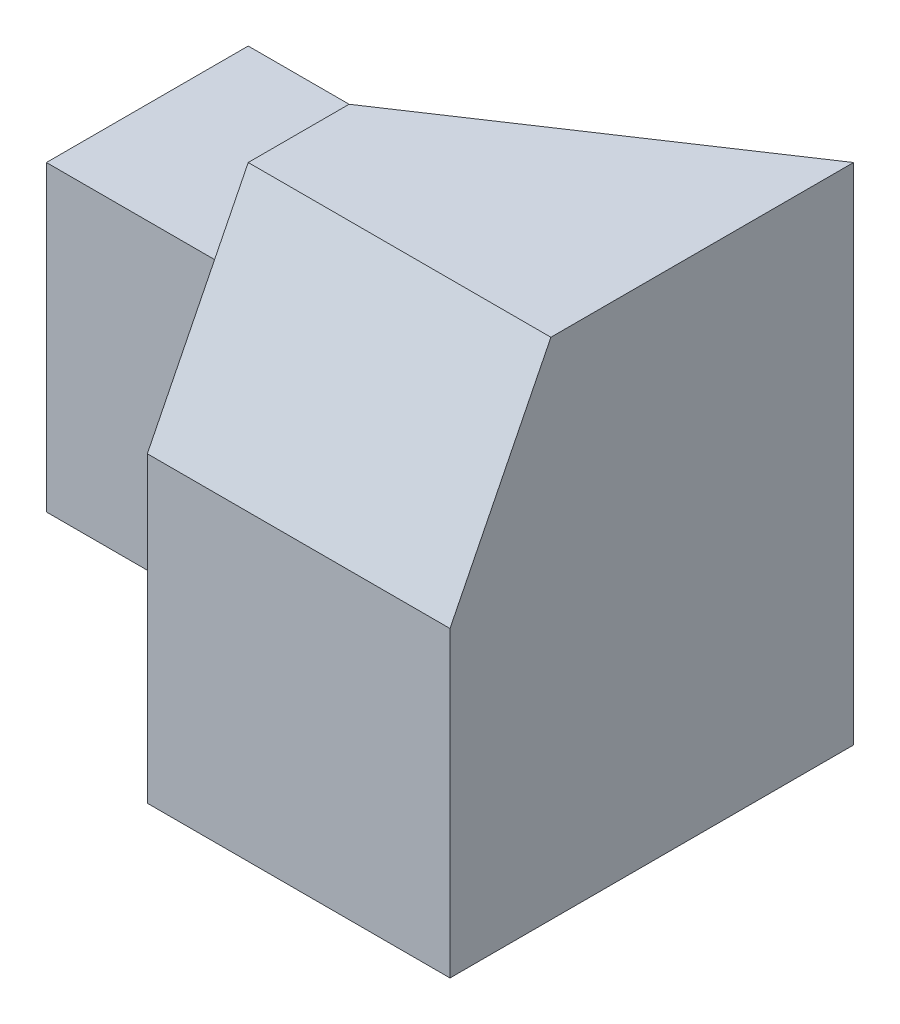
ISO-10303-21;
HEADER;
FILE_DESCRIPTION(('STEP AP214'),'2;1');
FILE_NAME('part.step','',(''),(''),'','','');
FILE_SCHEMA(('AUTOMOTIVE_DESIGN { 1 0 10303 214 1 1 1 1 }'));
ENDSEC;
DATA;
#1=APPLICATION_CONTEXT('core data for automotive mechanical design processes');
#2=APPLICATION_PROTOCOL_DEFINITION('international standard','automotive_design',2000,#1);
#3=PRODUCT_CONTEXT('',#1,'mechanical');
#4=PRODUCT('Part','Part','',(#3));
#5=PRODUCT_RELATED_PRODUCT_CATEGORY('part','',(#4));
#6=PRODUCT_DEFINITION_FORMATION('','',#4);
#7=PRODUCT_DEFINITION_CONTEXT('part definition',#1,'design');
#8=PRODUCT_DEFINITION('design','',#6,#7);
#9=PRODUCT_DEFINITION_SHAPE('','',#8);
#10=(LENGTH_UNIT() NAMED_UNIT(*) SI_UNIT(.MILLI.,.METRE.));
#11=(NAMED_UNIT(*) PLANE_ANGLE_UNIT() SI_UNIT($,.RADIAN.));
#12=(NAMED_UNIT(*) SI_UNIT($,.STERADIAN.) SOLID_ANGLE_UNIT());
#13=UNCERTAINTY_MEASURE_WITH_UNIT(LENGTH_MEASURE(1.E-05),#10,'distance_accuracy_value','');
#14=(GEOMETRIC_REPRESENTATION_CONTEXT(3) GLOBAL_UNCERTAINTY_ASSIGNED_CONTEXT((#13)) GLOBAL_UNIT_ASSIGNED_CONTEXT((#10,
#11,#12)) REPRESENTATION_CONTEXT('',''));
#15=CARTESIAN_POINT('',(0.,0.,0.));
#16=DIRECTION('',(0.,0.,1.));
#17=DIRECTION('',(1.,0.,0.));
#18=AXIS2_PLACEMENT_3D('',#15,#16,#17);
#19=CARTESIAN_POINT('',(0.,0.,20.));
#20=DIRECTION('',(1.,0.,0.));
#21=DIRECTION('',(0.,0.,-1.));
#22=AXIS2_PLACEMENT_3D('',#19,#20,#21);
#23=PLANE('',#22);
#24=DIRECTION('',(0.,-1.,0.));
#25=VECTOR('',#24,1.);
#26=CARTESIAN_POINT('',(0.,0.,10.));
#27=LINE('',#26,#25);
#28=CARTESIAN_POINT('',(0.,15.,10.));
#29=VERTEX_POINT('',#28);
#30=CARTESIAN_POINT('',(0.,0.,10.));
#31=VERTEX_POINT('',#30);
#32=EDGE_CURVE('E130',#29,#31,#27,.T.);
#33=ORIENTED_EDGE('',*,*,#32,.F.);
#34=DIRECTION('',(0.,0.,1.));
#35=VECTOR('',#34,1.);
#36=CARTESIAN_POINT('',(0.,15.,0.));
#37=LINE('',#36,#35);
#38=CARTESIAN_POINT('',(0.,15.,0.));
#39=VERTEX_POINT('',#38);
#40=EDGE_CURVE('E55',#39,#29,#37,.T.);
#41=ORIENTED_EDGE('',*,*,#40,.F.);
#42=DIRECTION('',(0.,-1.,0.));
#43=VECTOR('',#42,1.);
#44=CARTESIAN_POINT('',(0.,0.,0.));
#45=LINE('',#44,#43);
#46=CARTESIAN_POINT('',(0.,0.,0.));
#47=VERTEX_POINT('',#46);
#48=EDGE_CURVE('E137',#39,#47,#45,.T.);
#49=ORIENTED_EDGE('',*,*,#48,.T.);
#50=DIRECTION('',(0.,0.,-1.));
#51=VECTOR('',#50,1.);
#52=CARTESIAN_POINT('',(0.,0.,20.));
#53=LINE('',#52,#51);
#54=EDGE_CURVE('E11',#31,#47,#53,.T.);
#55=ORIENTED_EDGE('',*,*,#54,.F.);
#56=EDGE_LOOP('',(#33,#41,#49,#55));
#57=FACE_BOUND('',#56,.T.);
#58=ADVANCED_FACE('F33',(#57),#23,.F.);
#59=CARTESIAN_POINT('',(0.,0.,20.));
#60=DIRECTION('',(0.,1.,0.));
#61=DIRECTION('',(0.,0.,1.));
#62=AXIS2_PLACEMENT_3D('',#59,#60,#61);
#63=PLANE('',#62);
#64=DIRECTION('',(1.,0.,0.));
#65=VECTOR('',#64,1.);
#66=CARTESIAN_POINT('',(0.,0.,20.));
#67=LINE('',#66,#65);
#68=CARTESIAN_POINT('',(15.,0.,20.));
#69=VERTEX_POINT('',#68);
#70=CARTESIAN_POINT('',(30.,0.,20.));
#71=VERTEX_POINT('',#70);
#72=EDGE_CURVE('E139',#69,#71,#67,.T.);
#73=ORIENTED_EDGE('',*,*,#72,.F.);
#74=DIRECTION('',(0.,0.,1.));
#75=VECTOR('',#74,1.);
#76=CARTESIAN_POINT('',(15.,0.,10.));
#77=LINE('',#76,#75);
#78=CARTESIAN_POINT('',(15.,0.,10.));
#79=VERTEX_POINT('',#78);
#80=EDGE_CURVE('E127',#79,#69,#77,.T.);
#81=ORIENTED_EDGE('',*,*,#80,.F.);
#82=DIRECTION('',(1.,0.,0.));
#83=VECTOR('',#82,1.);
#84=CARTESIAN_POINT('',(0.,0.,10.));
#85=LINE('',#84,#83);
#86=EDGE_CURVE('E125',#31,#79,#85,.T.);
#87=ORIENTED_EDGE('',*,*,#86,.F.);
#88=ORIENTED_EDGE('',*,*,#54,.T.);
#89=DIRECTION('',(1.,0.,0.));
#90=VECTOR('',#89,1.);
#91=CARTESIAN_POINT('',(0.,0.,0.));
#92=LINE('',#91,#90);
#93=CARTESIAN_POINT('',(30.,0.,0.));
#94=VERTEX_POINT('',#93);
#95=EDGE_CURVE('E147',#47,#94,#92,.T.);
#96=ORIENTED_EDGE('',*,*,#95,.T.);
#97=DIRECTION('',(0.,0.,-1.));
#98=VECTOR('',#97,1.);
#99=CARTESIAN_POINT('',(30.,0.,20.));
#100=LINE('',#99,#98);
#101=EDGE_CURVE('E40',#71,#94,#100,.T.);
#102=ORIENTED_EDGE('',*,*,#101,.F.);
#103=EDGE_LOOP('',(#73,#81,#87,#88,#96,#102));
#104=FACE_BOUND('',#103,.T.);
#105=ADVANCED_FACE('F171',(#104),#63,.F.);
#106=CARTESIAN_POINT('',(30.,0.,20.));
#107=DIRECTION('',(-1.,0.,0.));
#108=DIRECTION('',(0.,0.,1.));
#109=AXIS2_PLACEMENT_3D('',#106,#107,#108);
#110=PLANE('',#109);
#111=DIRECTION('',(0.,0.,-1.));
#112=VECTOR('',#111,1.);
#113=CARTESIAN_POINT('',(30.,25.,20.));
#114=LINE('',#113,#112);
#115=CARTESIAN_POINT('',(30.,25.,15.));
#116=VERTEX_POINT('',#115);
#117=CARTESIAN_POINT('',(30.,25.,0.));
#118=VERTEX_POINT('',#117);
#119=EDGE_CURVE('E145',#116,#118,#114,.T.);
#120=ORIENTED_EDGE('',*,*,#119,.F.);
#121=DIRECTION('',(0.,-0.894427190999916,0.447213595499958));
#122=VECTOR('',#121,1.);
#123=CARTESIAN_POINT('',(30.,3.,26.));
#124=LINE('',#123,#122);
#125=CARTESIAN_POINT('',(30.,15.,20.));
#126=VERTEX_POINT('',#125);
#127=EDGE_CURVE('E121',#116,#126,#124,.T.);
#128=ORIENTED_EDGE('',*,*,#127,.T.);
#129=DIRECTION('',(0.,1.,0.));
#130=VECTOR('',#129,1.);
#131=CARTESIAN_POINT('',(30.,0.,20.));
#132=LINE('',#131,#130);
#133=EDGE_CURVE('E141',#71,#126,#132,.T.);
#134=ORIENTED_EDGE('',*,*,#133,.F.);
#135=ORIENTED_EDGE('',*,*,#101,.T.);
#136=DIRECTION('',(0.,1.,0.));
#137=VECTOR('',#136,1.);
#138=CARTESIAN_POINT('',(30.,0.,0.));
#139=LINE('',#138,#137);
#140=CARTESIAN_POINT('',(30.,15.,0.));
#141=VERTEX_POINT('',#140);
#142=EDGE_CURVE('E142',#94,#141,#139,.T.);
#143=ORIENTED_EDGE('',*,*,#142,.T.);
#144=DIRECTION('',(0.,1.,0.));
#145=VECTOR('',#144,1.);
#146=CARTESIAN_POINT('',(30.,15.,0.));
#147=LINE('',#146,#145);
#148=EDGE_CURVE('E105',#141,#118,#147,.T.);
#149=ORIENTED_EDGE('',*,*,#148,.T.);
#150=EDGE_LOOP('',(#120,#128,#134,#135,#143,#149));
#151=FACE_BOUND('',#150,.T.);
#152=ADVANCED_FACE('F157',(#151),#110,.F.);
#153=CARTESIAN_POINT('',(0.,25.,20.));
#154=DIRECTION('',(0.,-1.,0.));
#155=DIRECTION('',(0.,0.,-1.));
#156=AXIS2_PLACEMENT_3D('',#153,#154,#155);
#157=PLANE('',#156);
#158=ORIENTED_EDGE('',*,*,#119,.T.);
#159=DIRECTION('',(0.832050294337844,0.,-0.554700196225229));
#160=VECTOR('',#159,1.);
#161=CARTESIAN_POINT('',(15.,25.,10.));
#162=LINE('',#161,#160);
#163=CARTESIAN_POINT('',(15.,25.,10.));
#164=VERTEX_POINT('',#163);
#165=EDGE_CURVE('E107',#164,#118,#162,.T.);
#166=ORIENTED_EDGE('',*,*,#165,.F.);
#167=DIRECTION('',(0.,0.,1.));
#168=VECTOR('',#167,1.);
#169=CARTESIAN_POINT('',(15.,25.,10.));
#170=LINE('',#169,#168);
#171=CARTESIAN_POINT('',(15.,25.,15.));
#172=VERTEX_POINT('',#171);
#173=EDGE_CURVE('E47',#164,#172,#170,.T.);
#174=ORIENTED_EDGE('',*,*,#173,.T.);
#175=DIRECTION('',(-1.,0.,0.));
#176=VECTOR('',#175,1.);
#177=CARTESIAN_POINT('',(35.,25.,15.));
#178=LINE('',#177,#176);
#179=EDGE_CURVE('E269',#116,#172,#178,.T.);
#180=ORIENTED_EDGE('',*,*,#179,.F.);
#181=EDGE_LOOP('',(#158,#166,#174,#180));
#182=FACE_BOUND('',#181,.T.);
#183=ADVANCED_FACE('F179',(#182),#157,.F.);
#184=CARTESIAN_POINT('',(0.,0.,20.));
#185=DIRECTION('',(0.,0.,-1.));
#186=DIRECTION('',(-1.,0.,0.));
#187=AXIS2_PLACEMENT_3D('',#184,#185,#186);
#188=PLANE('',#187);
#189=ORIENTED_EDGE('',*,*,#133,.T.);
#190=DIRECTION('',(-1.,0.,0.));
#191=VECTOR('',#190,1.);
#192=CARTESIAN_POINT('',(35.,15.,20.));
#193=LINE('',#192,#191);
#194=CARTESIAN_POINT('',(15.,15.,20.));
#195=VERTEX_POINT('',#194);
#196=EDGE_CURVE('E272',#126,#195,#193,.T.);
#197=ORIENTED_EDGE('',*,*,#196,.T.);
#198=DIRECTION('',(0.,1.,0.));
#199=VECTOR('',#198,1.);
#200=CARTESIAN_POINT('',(15.,0.,20.));
#201=LINE('',#200,#199);
#202=EDGE_CURVE('E134',#69,#195,#201,.T.);
#203=ORIENTED_EDGE('',*,*,#202,.F.);
#204=ORIENTED_EDGE('',*,*,#72,.T.);
#205=EDGE_LOOP('',(#189,#197,#203,#204));
#206=FACE_BOUND('',#205,.T.);
#207=ADVANCED_FACE('F184',(#206),#188,.F.);
#208=CARTESIAN_POINT('',(0.,0.,0.));
#209=DIRECTION('',(0.,0.,-1.));
#210=DIRECTION('',(-1.,0.,0.));
#211=AXIS2_PLACEMENT_3D('',#208,#209,#210);
#212=PLANE('',#211);
#213=DIRECTION('',(1.,0.,0.));
#214=VECTOR('',#213,1.);
#215=CARTESIAN_POINT('',(0.,15.,0.));
#216=LINE('',#215,#214);
#217=EDGE_CURVE('E120',#39,#141,#216,.T.);
#218=ORIENTED_EDGE('',*,*,#217,.T.);
#219=ORIENTED_EDGE('',*,*,#142,.F.);
#220=ORIENTED_EDGE('',*,*,#95,.F.);
#221=ORIENTED_EDGE('',*,*,#48,.F.);
#222=EDGE_LOOP('',(#218,#219,#220,#221));
#223=FACE_BOUND('',#222,.T.);
#224=ADVANCED_FACE('F163',(#223),#212,.T.);
#225=CARTESIAN_POINT('',(15.,0.,10.));
#226=DIRECTION('',(1.,0.,0.));
#227=DIRECTION('',(0.,0.,-1.));
#228=AXIS2_PLACEMENT_3D('',#225,#226,#227);
#229=PLANE('',#228);
#230=ORIENTED_EDGE('',*,*,#173,.F.);
#231=DIRECTION('',(0.,1.,0.));
#232=VECTOR('',#231,1.);
#233=CARTESIAN_POINT('',(15.,15.,10.));
#234=LINE('',#233,#232);
#235=CARTESIAN_POINT('',(15.,15.,10.));
#236=VERTEX_POINT('',#235);
#237=EDGE_CURVE('E103',#236,#164,#234,.T.);
#238=ORIENTED_EDGE('',*,*,#237,.F.);
#239=DIRECTION('',(0.,1.,0.));
#240=VECTOR('',#239,1.);
#241=CARTESIAN_POINT('',(15.,0.,10.));
#242=LINE('',#241,#240);
#243=EDGE_CURVE('E112',#79,#236,#242,.T.);
#244=ORIENTED_EDGE('',*,*,#243,.F.);
#245=ORIENTED_EDGE('',*,*,#80,.T.);
#246=ORIENTED_EDGE('',*,*,#202,.T.);
#247=DIRECTION('',(0.,-0.894427190999916,0.447213595499958));
#248=VECTOR('',#247,1.);
#249=CARTESIAN_POINT('',(15.,25.,15.));
#250=LINE('',#249,#248);
#251=EDGE_CURVE('E270',#172,#195,#250,.T.);
#252=ORIENTED_EDGE('',*,*,#251,.F.);
#253=EDGE_LOOP('',(#230,#238,#244,#245,#246,#252));
#254=FACE_BOUND('',#253,.T.);
#255=ADVANCED_FACE('F110',(#254),#229,.F.);
#256=CARTESIAN_POINT('',(0.,0.,10.));
#257=DIRECTION('',(0.,0.,-1.));
#258=DIRECTION('',(-1.,0.,0.));
#259=AXIS2_PLACEMENT_3D('',#256,#257,#258);
#260=PLANE('',#259);
#261=ORIENTED_EDGE('',*,*,#243,.T.);
#262=DIRECTION('',(1.,0.,0.));
#263=VECTOR('',#262,1.);
#264=CARTESIAN_POINT('',(0.,15.,10.));
#265=LINE('',#264,#263);
#266=EDGE_CURVE('E116',#29,#236,#265,.T.);
#267=ORIENTED_EDGE('',*,*,#266,.F.);
#268=ORIENTED_EDGE('',*,*,#32,.T.);
#269=ORIENTED_EDGE('',*,*,#86,.T.);
#270=EDGE_LOOP('',(#261,#267,#268,#269));
#271=FACE_BOUND('',#270,.T.);
#272=ADVANCED_FACE('F123',(#271),#260,.F.);
#273=CARTESIAN_POINT('',(0.,15.,0.));
#274=DIRECTION('',(0.,-1.,0.));
#275=DIRECTION('',(0.,0.,-1.));
#276=AXIS2_PLACEMENT_3D('',#273,#274,#275);
#277=PLANE('',#276);
#278=ORIENTED_EDGE('',*,*,#266,.T.);
#279=DIRECTION('',(0.832050294337844,0.,-0.554700196225229));
#280=VECTOR('',#279,1.);
#281=CARTESIAN_POINT('',(15.,15.,10.));
#282=LINE('',#281,#280);
#283=EDGE_CURVE('E100',#236,#141,#282,.T.);
#284=ORIENTED_EDGE('',*,*,#283,.T.);
#285=ORIENTED_EDGE('',*,*,#217,.F.);
#286=ORIENTED_EDGE('',*,*,#40,.T.);
#287=EDGE_LOOP('',(#278,#284,#285,#286));
#288=FACE_BOUND('',#287,.T.);
#289=ADVANCED_FACE('F117',(#288),#277,.F.);
#290=CARTESIAN_POINT('',(35.,25.,15.));
#291=DIRECTION('',(0.,-0.447213595499958,-0.894427190999916));
#292=DIRECTION('',(0.,0.894427190999916,-0.447213595499958));
#293=AXIS2_PLACEMENT_3D('',#290,#291,#292);
#294=PLANE('',#293);
#295=ORIENTED_EDGE('',*,*,#179,.T.);
#296=ORIENTED_EDGE('',*,*,#251,.T.);
#297=ORIENTED_EDGE('',*,*,#196,.F.);
#298=ORIENTED_EDGE('',*,*,#127,.F.);
#299=EDGE_LOOP('',(#295,#296,#297,#298));
#300=FACE_BOUND('',#299,.T.);
#301=ADVANCED_FACE('F196',(#300),#294,.F.);
#302=CARTESIAN_POINT('',(15.,15.,10.));
#303=DIRECTION('',(0.554700196225229,0.,0.832050294337844));
#304=DIRECTION('',(0.832050294337844,0.,-0.554700196225229));
#305=AXIS2_PLACEMENT_3D('',#302,#303,#304);
#306=PLANE('',#305);
#307=ORIENTED_EDGE('',*,*,#165,.T.);
#308=ORIENTED_EDGE('',*,*,#148,.F.);
#309=ORIENTED_EDGE('',*,*,#283,.F.);
#310=ORIENTED_EDGE('',*,*,#237,.T.);
#311=EDGE_LOOP('',(#307,#308,#309,#310));
#312=FACE_BOUND('',#311,.T.);
#313=ADVANCED_FACE('F102',(#312),#306,.F.);
#314=CLOSED_SHELL('',(#58,#105,#152,#183,#207,#224,#255,#272,#289,#301,#313));
#315=MANIFOLD_SOLID_BREP('B2',#314);
#316=ADVANCED_BREP_SHAPE_REPRESENTATION('',(#18,#315),#14);
#317=SHAPE_DEFINITION_REPRESENTATION(#9,#316);
ENDSEC;
END-ISO-10303-21;
